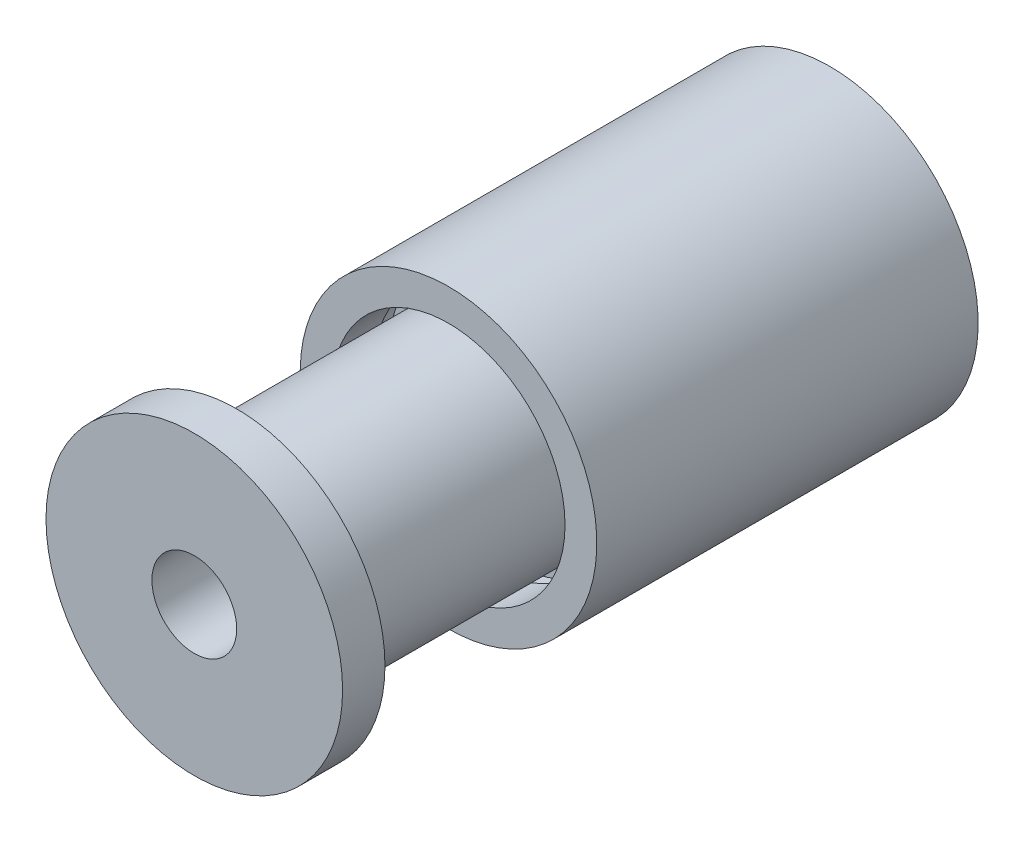
ISO-10303-21;
HEADER;
FILE_DESCRIPTION(('STEP AP214'),'2;1');
FILE_NAME('part.step','',(''),(''),'','','');
FILE_SCHEMA(('AUTOMOTIVE_DESIGN { 1 0 10303 214 1 1 1 1 }'));
ENDSEC;
DATA;
#1=APPLICATION_CONTEXT('core data for automotive mechanical design processes');
#2=APPLICATION_PROTOCOL_DEFINITION('international standard','automotive_design',2000,#1);
#3=PRODUCT_CONTEXT('',#1,'mechanical');
#4=PRODUCT('Part','Part','',(#3));
#5=PRODUCT_RELATED_PRODUCT_CATEGORY('part','',(#4));
#6=PRODUCT_DEFINITION_FORMATION('','',#4);
#7=PRODUCT_DEFINITION_CONTEXT('part definition',#1,'design');
#8=PRODUCT_DEFINITION('design','',#6,#7);
#9=PRODUCT_DEFINITION_SHAPE('','',#8);
#10=(LENGTH_UNIT() NAMED_UNIT(*) SI_UNIT(.MILLI.,.METRE.));
#11=(NAMED_UNIT(*) PLANE_ANGLE_UNIT() SI_UNIT($,.RADIAN.));
#12=(NAMED_UNIT(*) SI_UNIT($,.STERADIAN.) SOLID_ANGLE_UNIT());
#13=UNCERTAINTY_MEASURE_WITH_UNIT(LENGTH_MEASURE(1.E-05),#10,'distance_accuracy_value','');
#14=(GEOMETRIC_REPRESENTATION_CONTEXT(3) GLOBAL_UNCERTAINTY_ASSIGNED_CONTEXT((#13)) GLOBAL_UNIT_ASSIGNED_CONTEXT((#10,
#11,#12)) REPRESENTATION_CONTEXT('',''));
#15=CARTESIAN_POINT('',(0.,0.,0.));
#16=DIRECTION('',(0.,0.,1.));
#17=DIRECTION('',(1.,0.,0.));
#18=AXIS2_PLACEMENT_3D('',#15,#16,#17);
#19=CARTESIAN_POINT('',(0.,0.,10.));
#20=DIRECTION('',(0.,0.,-1.));
#21=DIRECTION('',(-1.,0.,0.));
#22=AXIS2_PLACEMENT_3D('',#19,#20,#21);
#23=PLANE('',#22);
#24=CARTESIAN_POINT('',(0.,0.,10.));
#25=DIRECTION('',(0.,0.,-1.));
#26=DIRECTION('',(-1.,0.,0.));
#27=AXIS2_PLACEMENT_3D('',#24,#25,#26);
#28=CIRCLE('',#27,27.5);
#29=CARTESIAN_POINT('',(-27.5,0.,10.));
#30=VERTEX_POINT('',#29);
#31=EDGE_CURVE('E11',#30,#30,#28,.T.);
#32=ORIENTED_EDGE('',*,*,#31,.T.);
#33=EDGE_LOOP('',(#32));
#34=FACE_BOUND('',#33,.T.);
#35=CARTESIAN_POINT('',(0.,0.,10.));
#36=DIRECTION('',(0.,0.,1.));
#37=DIRECTION('',(-0.892116802467122,-0.451804837021294,0.));
#38=AXIS2_PLACEMENT_3D('',#35,#36,#37);
#39=ELLIPSE('',#38,35.,35.);
#40=CARTESIAN_POINT('',(-31.2240880863493,-15.8131692957453,10.));
#41=VERTEX_POINT('',#40);
#42=EDGE_CURVE('E65',#41,#41,#39,.T.);
#43=ORIENTED_EDGE('',*,*,#42,.T.);
#44=EDGE_LOOP('',(#43));
#45=FACE_BOUND('',#44,.T.);
#46=ADVANCED_FACE('F49',(#34,#45),#23,.F.);
#47=CARTESIAN_POINT('',(0.,0.,0.));
#48=DIRECTION('',(0.,0.,-1.));
#49=DIRECTION('',(-1.,0.,0.));
#50=AXIS2_PLACEMENT_3D('',#47,#48,#49);
#51=PLANE('',#50);
#52=CARTESIAN_POINT('',(0.,0.,0.));
#53=DIRECTION('',(0.,0.,-1.));
#54=DIRECTION('',(-1.,0.,0.));
#55=AXIS2_PLACEMENT_3D('',#52,#53,#54);
#56=CIRCLE('',#55,27.5);
#57=CARTESIAN_POINT('',(-27.5,0.,0.));
#58=VERTEX_POINT('',#57);
#59=EDGE_CURVE('E53',#58,#58,#56,.T.);
#60=ORIENTED_EDGE('',*,*,#59,.F.);
#61=EDGE_LOOP('',(#60));
#62=FACE_BOUND('',#61,.T.);
#63=CARTESIAN_POINT('',(0.,0.,0.));
#64=DIRECTION('',(0.,0.,1.));
#65=DIRECTION('',(-0.82676146515211,0.562552646193703,0.));
#66=AXIS2_PLACEMENT_3D('',#63,#64,#65);
#67=ELLIPSE('',#66,30.,30.);
#68=CARTESIAN_POINT('',(-24.8028439545633,16.8765793858111,0.));
#69=VERTEX_POINT('',#68);
#70=EDGE_CURVE('E60',#69,#69,#67,.F.);
#71=ORIENTED_EDGE('',*,*,#70,.T.);
#72=EDGE_LOOP('',(#71));
#73=FACE_BOUND('',#72,.T.);
#74=ADVANCED_FACE('F51',(#62,#73),#51,.T.);
#75=CARTESIAN_POINT('',(0.,0.,10.));
#76=DIRECTION('',(0.,0.,-1.));
#77=DIRECTION('',(-1.,0.,0.));
#78=AXIS2_PLACEMENT_3D('',#75,#76,#77);
#79=CYLINDRICAL_SURFACE('',#78,27.5);
#80=ORIENTED_EDGE('',*,*,#31,.F.);
#81=EDGE_LOOP('',(#80));
#82=FACE_BOUND('',#81,.T.);
#83=ORIENTED_EDGE('',*,*,#59,.T.);
#84=EDGE_LOOP('',(#83));
#85=FACE_BOUND('',#84,.T.);
#86=ADVANCED_FACE('F79',(#82,#85),#79,.F.);
#87=CARTESIAN_POINT('',(0.,0.,-80.));
#88=DIRECTION('',(0.,0.,1.));
#89=DIRECTION('',(-0.892116802467122,-0.451804837021294,0.));
#90=AXIS2_PLACEMENT_3D('',#87,#88,#89);
#91=ELLIPSE('',#90,35.,35.);
#92=DIRECTION('',(0.,0.,1.));
#93=VECTOR('',#92,1.);
#94=SURFACE_OF_LINEAR_EXTRUSION('',#91,#93);
#95=CARTESIAN_POINT('',(-31.2240880863493,-15.8131692957453,-80.));
#96=VERTEX_POINT('',#95);
#97=EDGE_CURVE('E64',#96,#96,#91,.T.);
#98=ORIENTED_EDGE('',*,*,#97,.T.);
#99=EDGE_LOOP('',(#98));
#100=FACE_BOUND('',#99,.T.);
#101=ORIENTED_EDGE('',*,*,#42,.F.);
#102=EDGE_LOOP('',(#101));
#103=FACE_BOUND('',#102,.T.);
#104=ADVANCED_FACE('F74',(#100,#103),#94,.T.);
#105=CARTESIAN_POINT('',(0.,0.,-80.));
#106=DIRECTION('',(0.,0.,1.));
#107=DIRECTION('',(1.,0.,0.));
#108=AXIS2_PLACEMENT_3D('',#105,#106,#107);
#109=PLANE('',#108);
#110=CARTESIAN_POINT('',(0.,0.,-80.));
#111=DIRECTION('',(0.,0.,1.));
#112=DIRECTION('',(-0.82676146515211,0.562552646193703,0.));
#113=AXIS2_PLACEMENT_3D('',#110,#111,#112);
#114=ELLIPSE('',#113,30.,30.);
#115=CARTESIAN_POINT('',(-24.8028439545633,16.8765793858111,-80.));
#116=VERTEX_POINT('',#115);
#117=EDGE_CURVE('E68',#116,#116,#114,.T.);
#118=ORIENTED_EDGE('',*,*,#117,.T.);
#119=EDGE_LOOP('',(#118));
#120=FACE_BOUND('',#119,.T.);
#121=ORIENTED_EDGE('',*,*,#97,.F.);
#122=EDGE_LOOP('',(#121));
#123=FACE_BOUND('',#122,.T.);
#124=ADVANCED_FACE('F78',(#120,#123),#109,.F.);
#125=DIRECTION('',(0.,0.,1.));
#126=VECTOR('',#125,1.);
#127=SURFACE_OF_LINEAR_EXTRUSION('',#114,#126);
#128=ORIENTED_EDGE('',*,*,#70,.F.);
#129=EDGE_LOOP('',(#128));
#130=FACE_BOUND('',#129,.T.);
#131=ORIENTED_EDGE('',*,*,#117,.F.);
#132=EDGE_LOOP('',(#131));
#133=FACE_BOUND('',#132,.T.);
#134=ADVANCED_FACE('F98',(#130,#133),#127,.F.);
#135=CLOSED_SHELL('',(#46,#74,#86,#104,#124,#134));
#136=MANIFOLD_SOLID_BREP('B2',#135);
#137=CARTESIAN_POINT('',(0.,0.,70.));
#138=DIRECTION('',(0.,0.,-1.));
#139=DIRECTION('',(-1.,0.,0.));
#140=AXIS2_PLACEMENT_3D('',#137,#138,#139);
#141=CYLINDRICAL_SURFACE('',#140,25.);
#142=CARTESIAN_POINT('',(0.,0.,60.));
#143=DIRECTION('',(0.,0.,1.));
#144=DIRECTION('',(1.,0.,0.));
#145=AXIS2_PLACEMENT_3D('',#142,#143,#144);
#146=CIRCLE('',#145,25.);
#147=CARTESIAN_POINT('',(25.,0.,60.));
#148=VERTEX_POINT('',#147);
#149=EDGE_CURVE('E165',#148,#148,#146,.T.);
#150=ORIENTED_EDGE('',*,*,#149,.F.);
#151=EDGE_LOOP('',(#150));
#152=FACE_BOUND('',#151,.T.);
#153=CARTESIAN_POINT('',(0.,0.,-5.));
#154=DIRECTION('',(0.,0.,-1.));
#155=DIRECTION('',(-1.,0.,0.));
#156=AXIS2_PLACEMENT_3D('',#153,#154,#155);
#157=CIRCLE('',#156,25.);
#158=CARTESIAN_POINT('',(-25.,0.,-5.));
#159=VERTEX_POINT('',#158);
#160=EDGE_CURVE('E48',#159,#159,#157,.T.);
#161=ORIENTED_EDGE('',*,*,#160,.F.);
#162=EDGE_LOOP('',(#161));
#163=FACE_BOUND('',#162,.T.);
#164=ADVANCED_FACE('F158',(#152,#163),#141,.T.);
#165=CARTESIAN_POINT('',(0.,0.,70.));
#166=DIRECTION('',(0.,0.,1.));
#167=DIRECTION('',(1.,0.,0.));
#168=AXIS2_PLACEMENT_3D('',#165,#166,#167);
#169=PLANE('',#168);
#170=CARTESIAN_POINT('',(0.,0.,70.));
#171=DIRECTION('',(0.,0.,1.));
#172=DIRECTION('',(1.,0.,0.));
#173=AXIS2_PLACEMENT_3D('',#170,#171,#172);
#174=CIRCLE('',#173,10.);
#175=CARTESIAN_POINT('',(10.,0.,70.));
#176=VERTEX_POINT('',#175);
#177=EDGE_CURVE('E170',#176,#176,#174,.T.);
#178=ORIENTED_EDGE('',*,*,#177,.F.);
#179=EDGE_LOOP('',(#178));
#180=FACE_BOUND('',#179,.T.);
#181=CARTESIAN_POINT('',(0.,0.,70.));
#182=DIRECTION('',(0.,0.,1.));
#183=DIRECTION('',(1.,0.,0.));
#184=AXIS2_PLACEMENT_3D('',#181,#182,#183);
#185=CIRCLE('',#184,35.);
#186=CARTESIAN_POINT('',(35.,0.,70.));
#187=VERTEX_POINT('',#186);
#188=EDGE_CURVE('E178',#187,#187,#185,.T.);
#189=ORIENTED_EDGE('',*,*,#188,.T.);
#190=EDGE_LOOP('',(#189));
#191=FACE_BOUND('',#190,.T.);
#192=ADVANCED_FACE('F210',(#180,#191),#169,.T.);
#193=CARTESIAN_POINT('',(0.,0.,70.));
#194=DIRECTION('',(0.,0.,-1.));
#195=DIRECTION('',(-1.,0.,0.));
#196=AXIS2_PLACEMENT_3D('',#193,#194,#195);
#197=CYLINDRICAL_SURFACE('',#196,10.);
#198=ORIENTED_EDGE('',*,*,#177,.T.);
#199=EDGE_LOOP('',(#198));
#200=FACE_BOUND('',#199,.T.);
#201=CARTESIAN_POINT('',(0.,0.,-10.));
#202=DIRECTION('',(0.,0.,-1.));
#203=DIRECTION('',(-1.,0.,0.));
#204=AXIS2_PLACEMENT_3D('',#201,#202,#203);
#205=CIRCLE('',#204,10.);
#206=CARTESIAN_POINT('',(-10.,0.,-10.));
#207=VERTEX_POINT('',#206);
#208=EDGE_CURVE('E182',#207,#207,#205,.T.);
#209=ORIENTED_EDGE('',*,*,#208,.T.);
#210=EDGE_LOOP('',(#209));
#211=FACE_BOUND('',#210,.T.);
#212=ADVANCED_FACE('F215',(#200,#211),#197,.F.);
#213=CARTESIAN_POINT('',(0.,0.,60.));
#214=DIRECTION('',(0.,0.,1.));
#215=DIRECTION('',(1.,0.,0.));
#216=AXIS2_PLACEMENT_3D('',#213,#214,#215);
#217=CYLINDRICAL_SURFACE('',#216,35.);
#218=CARTESIAN_POINT('',(0.,0.,60.));
#219=DIRECTION('',(0.,0.,1.));
#220=DIRECTION('',(1.,0.,0.));
#221=AXIS2_PLACEMENT_3D('',#218,#219,#220);
#222=CIRCLE('',#221,35.);
#223=CARTESIAN_POINT('',(35.,0.,60.));
#224=VERTEX_POINT('',#223);
#225=EDGE_CURVE('E175',#224,#224,#222,.T.);
#226=ORIENTED_EDGE('',*,*,#225,.T.);
#227=EDGE_LOOP('',(#226));
#228=FACE_BOUND('',#227,.T.);
#229=ORIENTED_EDGE('',*,*,#188,.F.);
#230=EDGE_LOOP('',(#229));
#231=FACE_BOUND('',#230,.T.);
#232=ADVANCED_FACE('F221',(#228,#231),#217,.T.);
#233=CARTESIAN_POINT('',(0.,0.,60.));
#234=DIRECTION('',(0.,0.,1.));
#235=DIRECTION('',(1.,0.,0.));
#236=AXIS2_PLACEMENT_3D('',#233,#234,#235);
#237=PLANE('',#236);
#238=ORIENTED_EDGE('',*,*,#149,.T.);
#239=EDGE_LOOP('',(#238));
#240=FACE_BOUND('',#239,.T.);
#241=ORIENTED_EDGE('',*,*,#225,.F.);
#242=EDGE_LOOP('',(#241));
#243=FACE_BOUND('',#242,.T.);
#244=ADVANCED_FACE('F229',(#240,#243),#237,.F.);
#245=CARTESIAN_POINT('',(0.,0.,-10.));
#246=DIRECTION('',(0.,0.,-1.));
#247=DIRECTION('',(-1.,0.,0.));
#248=AXIS2_PLACEMENT_3D('',#245,#246,#247);
#249=PLANE('',#248);
#250=ORIENTED_EDGE('',*,*,#208,.F.);
#251=EDGE_LOOP('',(#250));
#252=FACE_BOUND('',#251,.T.);
#253=CARTESIAN_POINT('',(0.,0.,-10.));
#254=DIRECTION('',(0.,0.,-1.));
#255=DIRECTION('',(-1.,0.,0.));
#256=AXIS2_PLACEMENT_3D('',#253,#254,#255);
#257=CIRCLE('',#256,29.);
#258=CARTESIAN_POINT('',(-29.,0.,-10.));
#259=VERTEX_POINT('',#258);
#260=EDGE_CURVE('E190',#259,#259,#257,.T.);
#261=ORIENTED_EDGE('',*,*,#260,.T.);
#262=EDGE_LOOP('',(#261));
#263=FACE_BOUND('',#262,.T.);
#264=ADVANCED_FACE('F207',(#252,#263),#249,.T.);
#265=CARTESIAN_POINT('',(0.,0.,-5.));
#266=DIRECTION('',(0.,0.,-1.));
#267=DIRECTION('',(-1.,0.,0.));
#268=AXIS2_PLACEMENT_3D('',#265,#266,#267);
#269=CYLINDRICAL_SURFACE('',#268,29.);
#270=CARTESIAN_POINT('',(0.,0.,-5.));
#271=DIRECTION('',(0.,0.,-1.));
#272=DIRECTION('',(-1.,0.,0.));
#273=AXIS2_PLACEMENT_3D('',#270,#271,#272);
#274=CIRCLE('',#273,29.);
#275=CARTESIAN_POINT('',(-29.,0.,-5.));
#276=VERTEX_POINT('',#275);
#277=EDGE_CURVE('E189',#276,#276,#274,.T.);
#278=ORIENTED_EDGE('',*,*,#277,.T.);
#279=EDGE_LOOP('',(#278));
#280=FACE_BOUND('',#279,.T.);
#281=ORIENTED_EDGE('',*,*,#260,.F.);
#282=EDGE_LOOP('',(#281));
#283=FACE_BOUND('',#282,.T.);
#284=ADVANCED_FACE('F198',(#280,#283),#269,.T.);
#285=CARTESIAN_POINT('',(0.,0.,-5.));
#286=DIRECTION('',(0.,0.,-1.));
#287=DIRECTION('',(-1.,0.,0.));
#288=AXIS2_PLACEMENT_3D('',#285,#286,#287);
#289=PLANE('',#288);
#290=ORIENTED_EDGE('',*,*,#160,.T.);
#291=EDGE_LOOP('',(#290));
#292=FACE_BOUND('',#291,.T.);
#293=ORIENTED_EDGE('',*,*,#277,.F.);
#294=EDGE_LOOP('',(#293));
#295=FACE_BOUND('',#294,.T.);
#296=ADVANCED_FACE('F201',(#292,#295),#289,.F.);
#297=CLOSED_SHELL('',(#164,#192,#212,#232,#244,#264,#284,#296));
#298=MANIFOLD_SOLID_BREP('B6',#297);
#299=ADVANCED_BREP_SHAPE_REPRESENTATION('',(#18,#136,#298),#14);
#300=SHAPE_DEFINITION_REPRESENTATION(#9,#299);
ENDSEC;
END-ISO-10303-21;
